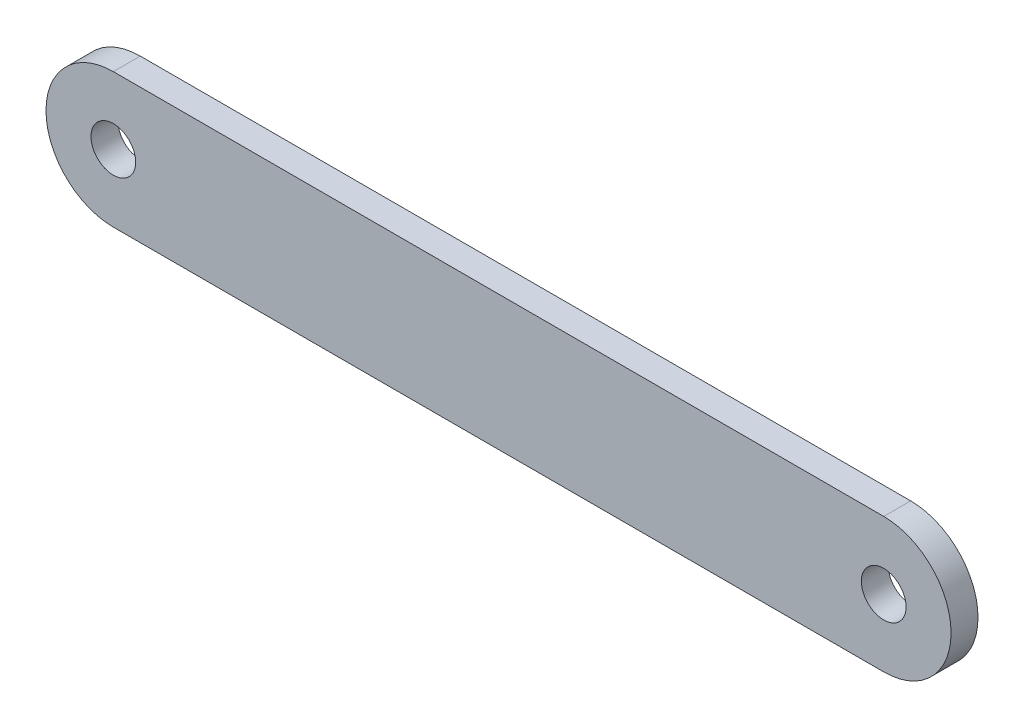
ISO-10303-21;
HEADER;
FILE_DESCRIPTION(('STEP AP214'),'2;1');
FILE_NAME('part.step','',(''),(''),'','','');
FILE_SCHEMA(('AUTOMOTIVE_DESIGN { 1 0 10303 214 1 1 1 1 }'));
ENDSEC;
DATA;
#1=APPLICATION_CONTEXT('core data for automotive mechanical design processes');
#2=APPLICATION_PROTOCOL_DEFINITION('international standard','automotive_design',2000,#1);
#3=PRODUCT_CONTEXT('',#1,'mechanical');
#4=PRODUCT('Part','Part','',(#3));
#5=PRODUCT_RELATED_PRODUCT_CATEGORY('part','',(#4));
#6=PRODUCT_DEFINITION_FORMATION('','',#4);
#7=PRODUCT_DEFINITION_CONTEXT('part definition',#1,'design');
#8=PRODUCT_DEFINITION('design','',#6,#7);
#9=PRODUCT_DEFINITION_SHAPE('','',#8);
#10=(LENGTH_UNIT() NAMED_UNIT(*) SI_UNIT(.MILLI.,.METRE.));
#11=(NAMED_UNIT(*) PLANE_ANGLE_UNIT() SI_UNIT($,.RADIAN.));
#12=(NAMED_UNIT(*) SI_UNIT($,.STERADIAN.) SOLID_ANGLE_UNIT());
#13=UNCERTAINTY_MEASURE_WITH_UNIT(LENGTH_MEASURE(1.E-05),#10,'distance_accuracy_value','');
#14=(GEOMETRIC_REPRESENTATION_CONTEXT(3) GLOBAL_UNCERTAINTY_ASSIGNED_CONTEXT((#13)) GLOBAL_UNIT_ASSIGNED_CONTEXT((#10,
#11,#12)) REPRESENTATION_CONTEXT('',''));
#15=CARTESIAN_POINT('',(0.,0.,0.));
#16=DIRECTION('',(0.,0.,1.));
#17=DIRECTION('',(1.,0.,0.));
#18=AXIS2_PLACEMENT_3D('',#15,#16,#17);
#19=CARTESIAN_POINT('',(0.,0.,5.));
#20=DIRECTION('',(0.,0.,1.));
#21=DIRECTION('',(1.,0.,0.));
#22=AXIS2_PLACEMENT_3D('',#19,#20,#21);
#23=PLANE('',#22);
#24=CARTESIAN_POINT('',(0.,0.,5.));
#25=DIRECTION('',(0.,0.,1.));
#26=DIRECTION('',(1.,0.,0.));
#27=AXIS2_PLACEMENT_3D('',#24,#25,#26);
#28=CIRCLE('',#27,4.15);
#29=CARTESIAN_POINT('',(4.15,0.,5.));
#30=VERTEX_POINT('',#29);
#31=EDGE_CURVE('E100',#30,#30,#28,.T.);
#32=ORIENTED_EDGE('',*,*,#31,.F.);
#33=EDGE_LOOP('',(#32));
#34=FACE_BOUND('',#33,.T.);
#35=CARTESIAN_POINT('',(0.,0.,5.));
#36=DIRECTION('',(0.,0.,1.));
#37=DIRECTION('',(1.,0.,0.));
#38=AXIS2_PLACEMENT_3D('',#35,#36,#37);
#39=CIRCLE('',#38,12.5);
#40=CARTESIAN_POINT('',(0.,12.5,5.));
#41=VERTEX_POINT('',#40);
#42=CARTESIAN_POINT('',(0.,-12.5,5.));
#43=VERTEX_POINT('',#42);
#44=EDGE_CURVE('E85',#41,#43,#39,.T.);
#45=ORIENTED_EDGE('',*,*,#44,.T.);
#46=DIRECTION('',(1.,0.,0.));
#47=VECTOR('',#46,1.);
#48=CARTESIAN_POINT('',(0.,-12.5,5.));
#49=LINE('',#48,#47);
#50=CARTESIAN_POINT('',(143.,-12.5,5.));
#51=VERTEX_POINT('',#50);
#52=EDGE_CURVE('E80',#43,#51,#49,.T.);
#53=ORIENTED_EDGE('',*,*,#52,.T.);
#54=CARTESIAN_POINT('',(143.,0.,5.));
#55=DIRECTION('',(0.,0.,1.));
#56=DIRECTION('',(-1.,0.,0.));
#57=AXIS2_PLACEMENT_3D('',#54,#55,#56);
#58=CIRCLE('',#57,12.5);
#59=CARTESIAN_POINT('',(143.,12.5,5.));
#60=VERTEX_POINT('',#59);
#61=EDGE_CURVE('E83',#51,#60,#58,.T.);
#62=ORIENTED_EDGE('',*,*,#61,.T.);
#63=DIRECTION('',(-1.,0.,0.));
#64=VECTOR('',#63,1.);
#65=CARTESIAN_POINT('',(0.,12.5,5.));
#66=LINE('',#65,#64);
#67=EDGE_CURVE('E50',#60,#41,#66,.T.);
#68=ORIENTED_EDGE('',*,*,#67,.T.);
#69=EDGE_LOOP('',(#45,#53,#62,#68));
#70=FACE_BOUND('',#69,.T.);
#71=CARTESIAN_POINT('',(143.,0.,5.));
#72=DIRECTION('',(0.,0.,1.));
#73=DIRECTION('',(1.,0.,0.));
#74=AXIS2_PLACEMENT_3D('',#71,#72,#73);
#75=CIRCLE('',#74,4.15000000000001);
#76=CARTESIAN_POINT('',(147.15,0.,5.));
#77=VERTEX_POINT('',#76);
#78=EDGE_CURVE('E115',#77,#77,#75,.T.);
#79=ORIENTED_EDGE('',*,*,#78,.F.);
#80=EDGE_LOOP('',(#79));
#81=FACE_BOUND('',#80,.T.);
#82=ADVANCED_FACE('F33',(#34,#70,#81),#23,.T.);
#83=CARTESIAN_POINT('',(0.,0.,0.));
#84=DIRECTION('',(0.,0.,1.));
#85=DIRECTION('',(1.,0.,0.));
#86=AXIS2_PLACEMENT_3D('',#83,#84,#85);
#87=PLANE('',#86);
#88=CARTESIAN_POINT('',(0.,0.,0.));
#89=DIRECTION('',(0.,0.,1.));
#90=DIRECTION('',(1.,0.,0.));
#91=AXIS2_PLACEMENT_3D('',#88,#89,#90);
#92=CIRCLE('',#91,4.15);
#93=CARTESIAN_POINT('',(4.15,0.,0.));
#94=VERTEX_POINT('',#93);
#95=EDGE_CURVE('E112',#94,#94,#92,.T.);
#96=ORIENTED_EDGE('',*,*,#95,.T.);
#97=EDGE_LOOP('',(#96));
#98=FACE_BOUND('',#97,.T.);
#99=CARTESIAN_POINT('',(0.,0.,0.));
#100=DIRECTION('',(0.,0.,1.));
#101=DIRECTION('',(1.,0.,0.));
#102=AXIS2_PLACEMENT_3D('',#99,#100,#101);
#103=CIRCLE('',#102,12.5);
#104=CARTESIAN_POINT('',(0.,12.5,0.));
#105=VERTEX_POINT('',#104);
#106=CARTESIAN_POINT('',(0.,-12.5,0.));
#107=VERTEX_POINT('',#106);
#108=EDGE_CURVE('E97',#105,#107,#103,.T.);
#109=ORIENTED_EDGE('',*,*,#108,.F.);
#110=DIRECTION('',(-1.,0.,0.));
#111=VECTOR('',#110,1.);
#112=CARTESIAN_POINT('',(0.,12.5,0.));
#113=LINE('',#112,#111);
#114=CARTESIAN_POINT('',(143.,12.5,0.));
#115=VERTEX_POINT('',#114);
#116=EDGE_CURVE('E73',#115,#105,#113,.T.);
#117=ORIENTED_EDGE('',*,*,#116,.F.);
#118=CARTESIAN_POINT('',(143.,0.,0.));
#119=DIRECTION('',(0.,0.,1.));
#120=DIRECTION('',(-1.,0.,0.));
#121=AXIS2_PLACEMENT_3D('',#118,#119,#120);
#122=CIRCLE('',#121,12.5);
#123=CARTESIAN_POINT('',(143.,-12.5,0.));
#124=VERTEX_POINT('',#123);
#125=EDGE_CURVE('E67',#124,#115,#122,.T.);
#126=ORIENTED_EDGE('',*,*,#125,.F.);
#127=DIRECTION('',(1.,0.,0.));
#128=VECTOR('',#127,1.);
#129=CARTESIAN_POINT('',(0.,-12.5,0.));
#130=LINE('',#129,#128);
#131=EDGE_CURVE('E89',#107,#124,#130,.T.);
#132=ORIENTED_EDGE('',*,*,#131,.F.);
#133=EDGE_LOOP('',(#109,#117,#126,#132));
#134=FACE_BOUND('',#133,.T.);
#135=CARTESIAN_POINT('',(143.,0.,0.));
#136=DIRECTION('',(0.,0.,1.));
#137=DIRECTION('',(1.,0.,0.));
#138=AXIS2_PLACEMENT_3D('',#135,#136,#137);
#139=CIRCLE('',#138,4.15000000000001);
#140=CARTESIAN_POINT('',(147.15,0.,0.));
#141=VERTEX_POINT('',#140);
#142=EDGE_CURVE('E118',#141,#141,#139,.T.);
#143=ORIENTED_EDGE('',*,*,#142,.T.);
#144=EDGE_LOOP('',(#143));
#145=FACE_BOUND('',#144,.T.);
#146=ADVANCED_FACE('F108',(#98,#134,#145),#87,.F.);
#147=CARTESIAN_POINT('',(0.,0.,5.));
#148=DIRECTION('',(0.,0.,-1.));
#149=DIRECTION('',(-1.,0.,0.));
#150=AXIS2_PLACEMENT_3D('',#147,#148,#149);
#151=CYLINDRICAL_SURFACE('',#150,12.5);
#152=ORIENTED_EDGE('',*,*,#108,.T.);
#153=DIRECTION('',(0.,0.,-1.));
#154=VECTOR('',#153,1.);
#155=CARTESIAN_POINT('',(0.,-12.5,5.));
#156=LINE('',#155,#154);
#157=EDGE_CURVE('E11',#43,#107,#156,.T.);
#158=ORIENTED_EDGE('',*,*,#157,.F.);
#159=ORIENTED_EDGE('',*,*,#44,.F.);
#160=DIRECTION('',(0.,0.,-1.));
#161=VECTOR('',#160,1.);
#162=CARTESIAN_POINT('',(0.,12.5,5.));
#163=LINE('',#162,#161);
#164=EDGE_CURVE('E93',#41,#105,#163,.T.);
#165=ORIENTED_EDGE('',*,*,#164,.T.);
#166=EDGE_LOOP('',(#152,#158,#159,#165));
#167=FACE_BOUND('',#166,.T.);
#168=ADVANCED_FACE('F35',(#167),#151,.T.);
#169=CARTESIAN_POINT('',(0.,-12.5,5.));
#170=DIRECTION('',(0.,1.,0.));
#171=DIRECTION('',(0.,0.,1.));
#172=AXIS2_PLACEMENT_3D('',#169,#170,#171);
#173=PLANE('',#172);
#174=ORIENTED_EDGE('',*,*,#131,.T.);
#175=DIRECTION('',(0.,0.,-1.));
#176=VECTOR('',#175,1.);
#177=CARTESIAN_POINT('',(143.,-12.5,5.));
#178=LINE('',#177,#176);
#179=EDGE_CURVE('E42',#51,#124,#178,.T.);
#180=ORIENTED_EDGE('',*,*,#179,.F.);
#181=ORIENTED_EDGE('',*,*,#52,.F.);
#182=ORIENTED_EDGE('',*,*,#157,.T.);
#183=EDGE_LOOP('',(#174,#180,#181,#182));
#184=FACE_BOUND('',#183,.T.);
#185=ADVANCED_FACE('F88',(#184),#173,.F.);
#186=CARTESIAN_POINT('',(143.,0.,5.));
#187=DIRECTION('',(0.,0.,-1.));
#188=DIRECTION('',(-1.,0.,0.));
#189=AXIS2_PLACEMENT_3D('',#186,#187,#188);
#190=CYLINDRICAL_SURFACE('',#189,12.5);
#191=ORIENTED_EDGE('',*,*,#125,.T.);
#192=DIRECTION('',(0.,0.,-1.));
#193=VECTOR('',#192,1.);
#194=CARTESIAN_POINT('',(143.,12.5,5.));
#195=LINE('',#194,#193);
#196=EDGE_CURVE('E90',#60,#115,#195,.T.);
#197=ORIENTED_EDGE('',*,*,#196,.F.);
#198=ORIENTED_EDGE('',*,*,#61,.F.);
#199=ORIENTED_EDGE('',*,*,#179,.T.);
#200=EDGE_LOOP('',(#191,#197,#198,#199));
#201=FACE_BOUND('',#200,.T.);
#202=ADVANCED_FACE('F91',(#201),#190,.T.);
#203=CARTESIAN_POINT('',(0.,12.5,5.));
#204=DIRECTION('',(0.,-1.,0.));
#205=DIRECTION('',(0.,0.,-1.));
#206=AXIS2_PLACEMENT_3D('',#203,#204,#205);
#207=PLANE('',#206);
#208=ORIENTED_EDGE('',*,*,#116,.T.);
#209=ORIENTED_EDGE('',*,*,#164,.F.);
#210=ORIENTED_EDGE('',*,*,#67,.F.);
#211=ORIENTED_EDGE('',*,*,#196,.T.);
#212=EDGE_LOOP('',(#208,#209,#210,#211));
#213=FACE_BOUND('',#212,.T.);
#214=ADVANCED_FACE('F105',(#213),#207,.F.);
#215=CARTESIAN_POINT('',(0.,0.,5.));
#216=DIRECTION('',(0.,0.,-1.));
#217=DIRECTION('',(-1.,0.,0.));
#218=AXIS2_PLACEMENT_3D('',#215,#216,#217);
#219=CYLINDRICAL_SURFACE('',#218,4.15);
#220=ORIENTED_EDGE('',*,*,#31,.T.);
#221=EDGE_LOOP('',(#220));
#222=FACE_BOUND('',#221,.T.);
#223=ORIENTED_EDGE('',*,*,#95,.F.);
#224=EDGE_LOOP('',(#223));
#225=FACE_BOUND('',#224,.T.);
#226=ADVANCED_FACE('F136',(#222,#225),#219,.F.);
#227=CARTESIAN_POINT('',(143.,0.,5.));
#228=DIRECTION('',(0.,0.,-1.));
#229=DIRECTION('',(-1.,0.,0.));
#230=AXIS2_PLACEMENT_3D('',#227,#228,#229);
#231=CYLINDRICAL_SURFACE('',#230,4.15000000000001);
#232=ORIENTED_EDGE('',*,*,#78,.T.);
#233=EDGE_LOOP('',(#232));
#234=FACE_BOUND('',#233,.T.);
#235=ORIENTED_EDGE('',*,*,#142,.F.);
#236=EDGE_LOOP('',(#235));
#237=FACE_BOUND('',#236,.T.);
#238=ADVANCED_FACE('F124',(#234,#237),#231,.F.);
#239=CLOSED_SHELL('',(#82,#146,#168,#185,#202,#214,#226,#238));
#240=MANIFOLD_SOLID_BREP('B2',#239);
#241=ADVANCED_BREP_SHAPE_REPRESENTATION('',(#18,#240),#14);
#242=SHAPE_DEFINITION_REPRESENTATION(#9,#241);
ENDSEC;
END-ISO-10303-21;
